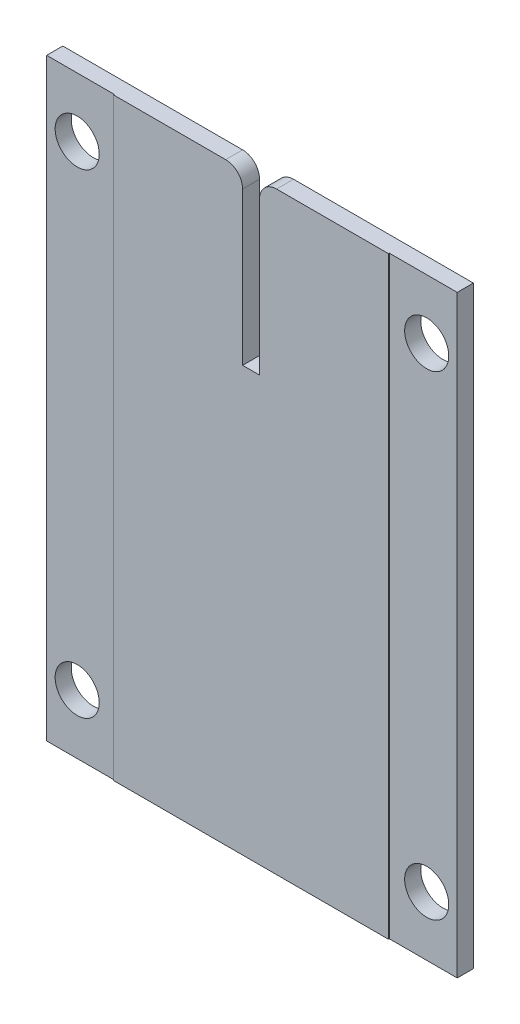
ISO-10303-21;
HEADER;
FILE_DESCRIPTION(('STEP AP214'),'2;1');
FILE_NAME('part.step','',(''),(''),'','','');
FILE_SCHEMA(('AUTOMOTIVE_DESIGN { 1 0 10303 214 1 1 1 1 }'));
ENDSEC;
DATA;
#1=APPLICATION_CONTEXT('core data for automotive mechanical design processes');
#2=APPLICATION_PROTOCOL_DEFINITION('international standard','automotive_design',2000,#1);
#3=PRODUCT_CONTEXT('',#1,'mechanical');
#4=PRODUCT('Part','Part','',(#3));
#5=PRODUCT_RELATED_PRODUCT_CATEGORY('part','',(#4));
#6=PRODUCT_DEFINITION_FORMATION('','',#4);
#7=PRODUCT_DEFINITION_CONTEXT('part definition',#1,'design');
#8=PRODUCT_DEFINITION('design','',#6,#7);
#9=PRODUCT_DEFINITION_SHAPE('','',#8);
#10=(LENGTH_UNIT() NAMED_UNIT(*) SI_UNIT(.MILLI.,.METRE.));
#11=(NAMED_UNIT(*) PLANE_ANGLE_UNIT() SI_UNIT($,.RADIAN.));
#12=(NAMED_UNIT(*) SI_UNIT($,.STERADIAN.) SOLID_ANGLE_UNIT());
#13=UNCERTAINTY_MEASURE_WITH_UNIT(LENGTH_MEASURE(1.E-05),#10,'distance_accuracy_value','');
#14=(GEOMETRIC_REPRESENTATION_CONTEXT(3) GLOBAL_UNCERTAINTY_ASSIGNED_CONTEXT((#13)) GLOBAL_UNIT_ASSIGNED_CONTEXT((#10,
#11,#12)) REPRESENTATION_CONTEXT('',''));
#15=CARTESIAN_POINT('',(0.,0.,0.));
#16=DIRECTION('',(0.,0.,1.));
#17=DIRECTION('',(1.,0.,0.));
#18=AXIS2_PLACEMENT_3D('',#15,#16,#17);
#19=CARTESIAN_POINT('',(121.,175.,10.));
#20=DIRECTION('',(0.,-1.,0.));
#21=DIRECTION('',(1.,0.,0.));
#22=AXIS2_PLACEMENT_3D('',#19,#20,#21);
#23=PLANE('',#22);
#24=DIRECTION('',(-1.,0.,0.));
#25=VECTOR('',#24,1.);
#26=CARTESIAN_POINT('',(121.,175.,0.));
#27=LINE('',#26,#25);
#28=CARTESIAN_POINT('',(121.,175.,0.));
#29=VERTEX_POINT('',#28);
#30=CARTESIAN_POINT('',(15.,175.,0.));
#31=VERTEX_POINT('',#30);
#32=EDGE_CURVE('E227',#29,#31,#27,.T.);
#33=ORIENTED_EDGE('',*,*,#32,.T.);
#34=DIRECTION('',(0.,0.,1.));
#35=VECTOR('',#34,1.);
#36=CARTESIAN_POINT('',(15.,175.,10.));
#37=LINE('',#36,#35);
#38=CARTESIAN_POINT('',(15.,175.,10.));
#39=VERTEX_POINT('',#38);
#40=EDGE_CURVE('E41',#31,#39,#37,.T.);
#41=ORIENTED_EDGE('',*,*,#40,.T.);
#42=DIRECTION('',(-1.,0.,0.));
#43=VECTOR('',#42,1.);
#44=CARTESIAN_POINT('',(121.,175.,10.));
#45=LINE('',#44,#43);
#46=CARTESIAN_POINT('',(81.,175.,10.));
#47=VERTEX_POINT('',#46);
#48=EDGE_CURVE('E228',#47,#39,#45,.T.);
#49=ORIENTED_EDGE('',*,*,#48,.F.);
#50=DIRECTION('',(0.,0.,1.));
#51=VECTOR('',#50,1.);
#52=CARTESIAN_POINT('',(81.,175.,9.5));
#53=LINE('',#52,#51);
#54=CARTESIAN_POINT('',(81.,175.,9.5));
#55=VERTEX_POINT('',#54);
#56=EDGE_CURVE('E179',#55,#47,#53,.T.);
#57=ORIENTED_EDGE('',*,*,#56,.F.);
#58=DIRECTION('',(-1.,0.,0.));
#59=VECTOR('',#58,1.);
#60=CARTESIAN_POINT('',(121.,175.,9.5));
#61=LINE('',#60,#59);
#62=CARTESIAN_POINT('',(121.,175.,9.5));
#63=VERTEX_POINT('',#62);
#64=EDGE_CURVE('E171',#63,#55,#61,.T.);
#65=ORIENTED_EDGE('',*,*,#64,.F.);
#66=DIRECTION('',(0.,0.,-1.));
#67=VECTOR('',#66,1.);
#68=CARTESIAN_POINT('',(121.,175.,10.));
#69=LINE('',#68,#67);
#70=EDGE_CURVE('E244',#63,#29,#69,.T.);
#71=ORIENTED_EDGE('',*,*,#70,.T.);
#72=EDGE_LOOP('',(#33,#41,#49,#57,#65,#71));
#73=FACE_BOUND('',#72,.T.);
#74=ADVANCED_FACE('F33',(#73),#23,.F.);
#75=CARTESIAN_POINT('',(-121.,-175.,10.));
#76=DIRECTION('',(1.,0.,0.));
#77=DIRECTION('',(0.,0.,-1.));
#78=AXIS2_PLACEMENT_3D('',#75,#76,#77);
#79=PLANE('',#78);
#80=DIRECTION('',(0.,-1.,0.));
#81=VECTOR('',#80,1.);
#82=CARTESIAN_POINT('',(-121.,175.,9.5));
#83=LINE('',#82,#81);
#84=CARTESIAN_POINT('',(-121.,175.,9.5));
#85=VERTEX_POINT('',#84);
#86=CARTESIAN_POINT('',(-121.,-175.,9.5));
#87=VERTEX_POINT('',#86);
#88=EDGE_CURVE('E190',#85,#87,#83,.T.);
#89=ORIENTED_EDGE('',*,*,#88,.F.);
#90=DIRECTION('',(0.,0.,-1.));
#91=VECTOR('',#90,1.);
#92=CARTESIAN_POINT('',(-121.,175.,10.));
#93=LINE('',#92,#91);
#94=CARTESIAN_POINT('',(-121.,175.,0.));
#95=VERTEX_POINT('',#94);
#96=EDGE_CURVE('E231',#85,#95,#93,.T.);
#97=ORIENTED_EDGE('',*,*,#96,.T.);
#98=DIRECTION('',(0.,-1.,0.));
#99=VECTOR('',#98,1.);
#100=CARTESIAN_POINT('',(-121.,-175.,0.));
#101=LINE('',#100,#99);
#102=CARTESIAN_POINT('',(-121.,-175.,0.));
#103=VERTEX_POINT('',#102);
#104=EDGE_CURVE('E222',#95,#103,#101,.T.);
#105=ORIENTED_EDGE('',*,*,#104,.T.);
#106=DIRECTION('',(0.,0.,-1.));
#107=VECTOR('',#106,1.);
#108=CARTESIAN_POINT('',(-121.,-175.,10.));
#109=LINE('',#108,#107);
#110=EDGE_CURVE('E248',#87,#103,#109,.T.);
#111=ORIENTED_EDGE('',*,*,#110,.F.);
#112=EDGE_LOOP('',(#89,#97,#105,#111));
#113=FACE_BOUND('',#112,.T.);
#114=ADVANCED_FACE('F295',(#113),#79,.F.);
#115=CARTESIAN_POINT('',(-103.,140.,10.));
#116=DIRECTION('',(0.,0.,-1.));
#117=DIRECTION('',(-1.,0.,0.));
#118=AXIS2_PLACEMENT_3D('',#115,#116,#117);
#119=CYLINDRICAL_SURFACE('',#118,13.);
#120=CARTESIAN_POINT('',(-103.,140.,0.));
#121=DIRECTION('',(0.,0.,1.));
#122=DIRECTION('',(1.,0.,0.));
#123=AXIS2_PLACEMENT_3D('',#120,#121,#122);
#124=CIRCLE('',#123,13.);
#125=CARTESIAN_POINT('',(-90.,140.,0.));
#126=VERTEX_POINT('',#125);
#127=EDGE_CURVE('E219',#126,#126,#124,.T.);
#128=ORIENTED_EDGE('',*,*,#127,.F.);
#129=EDGE_LOOP('',(#128));
#130=FACE_BOUND('',#129,.T.);
#131=CARTESIAN_POINT('',(-103.,140.,9.5));
#132=DIRECTION('',(0.,0.,1.));
#133=DIRECTION('',(1.,0.,0.));
#134=AXIS2_PLACEMENT_3D('',#131,#132,#133);
#135=CIRCLE('',#134,13.);
#136=CARTESIAN_POINT('',(-90.,140.,9.5));
#137=VERTEX_POINT('',#136);
#138=EDGE_CURVE('E207',#137,#137,#135,.T.);
#139=ORIENTED_EDGE('',*,*,#138,.T.);
#140=EDGE_LOOP('',(#139));
#141=FACE_BOUND('',#140,.T.);
#142=ADVANCED_FACE('F314',(#130,#141),#119,.F.);
#143=CARTESIAN_POINT('',(-103.,-140.,10.));
#144=DIRECTION('',(0.,0.,-1.));
#145=DIRECTION('',(-1.,0.,0.));
#146=AXIS2_PLACEMENT_3D('',#143,#144,#145);
#147=CYLINDRICAL_SURFACE('',#146,13.);
#148=CARTESIAN_POINT('',(-103.,-140.,0.));
#149=DIRECTION('',(0.,0.,1.));
#150=DIRECTION('',(1.,0.,0.));
#151=AXIS2_PLACEMENT_3D('',#148,#149,#150);
#152=CIRCLE('',#151,13.);
#153=CARTESIAN_POINT('',(-90.,-140.,0.));
#154=VERTEX_POINT('',#153);
#155=EDGE_CURVE('E216',#154,#154,#152,.T.);
#156=ORIENTED_EDGE('',*,*,#155,.F.);
#157=EDGE_LOOP('',(#156));
#158=FACE_BOUND('',#157,.T.);
#159=CARTESIAN_POINT('',(-103.,-140.,9.5));
#160=DIRECTION('',(0.,0.,1.));
#161=DIRECTION('',(1.,0.,0.));
#162=AXIS2_PLACEMENT_3D('',#159,#160,#161);
#163=CIRCLE('',#162,13.);
#164=CARTESIAN_POINT('',(-90.,-140.,9.5));
#165=VERTEX_POINT('',#164);
#166=EDGE_CURVE('E205',#165,#165,#163,.T.);
#167=ORIENTED_EDGE('',*,*,#166,.T.);
#168=EDGE_LOOP('',(#167));
#169=FACE_BOUND('',#168,.T.);
#170=ADVANCED_FACE('F337',(#158,#169),#147,.F.);
#171=CARTESIAN_POINT('',(0.,0.,10.));
#172=DIRECTION('',(0.,0.,1.));
#173=DIRECTION('',(1.,0.,0.));
#174=AXIS2_PLACEMENT_3D('',#171,#172,#173);
#175=PLANE('',#174);
#176=DIRECTION('',(0.,-1.,0.));
#177=VECTOR('',#176,1.);
#178=CARTESIAN_POINT('',(-5.00000000000002,75.,10.));
#179=LINE('',#178,#177);
#180=CARTESIAN_POINT('',(-5.00000000000002,165.,10.));
#181=VERTEX_POINT('',#180);
#182=CARTESIAN_POINT('',(-5.00000000000002,75.,10.));
#183=VERTEX_POINT('',#182);
#184=EDGE_CURVE('E152',#181,#183,#179,.T.);
#185=ORIENTED_EDGE('',*,*,#184,.F.);
#186=CARTESIAN_POINT('',(-15.,165.,10.));
#187=DIRECTION('',(0.,0.,1.));
#188=DIRECTION('',(1.,0.,0.));
#189=AXIS2_PLACEMENT_3D('',#186,#187,#188);
#190=CIRCLE('',#189,10.);
#191=CARTESIAN_POINT('',(-15.,175.,10.));
#192=VERTEX_POINT('',#191);
#193=EDGE_CURVE('E258',#181,#192,#190,.T.);
#194=ORIENTED_EDGE('',*,*,#193,.T.);
#195=CARTESIAN_POINT('',(-81.,175.,10.));
#196=VERTEX_POINT('',#195);
#197=EDGE_CURVE('E226',#192,#196,#45,.T.);
#198=ORIENTED_EDGE('',*,*,#197,.T.);
#199=DIRECTION('',(0.,1.,0.));
#200=VECTOR('',#199,1.);
#201=CARTESIAN_POINT('',(-81.,175.,10.));
#202=LINE('',#201,#200);
#203=CARTESIAN_POINT('',(-80.9999999999999,-175.,10.));
#204=VERTEX_POINT('',#203);
#205=EDGE_CURVE('E189',#204,#196,#202,.T.);
#206=ORIENTED_EDGE('',*,*,#205,.F.);
#207=DIRECTION('',(1.,0.,0.));
#208=VECTOR('',#207,1.);
#209=CARTESIAN_POINT('',(121.,-175.,10.));
#210=LINE('',#209,#208);
#211=CARTESIAN_POINT('',(81.,-175.,10.));
#212=VERTEX_POINT('',#211);
#213=EDGE_CURVE('E223',#204,#212,#210,.T.);
#214=ORIENTED_EDGE('',*,*,#213,.T.);
#215=DIRECTION('',(0.,-1.,0.));
#216=VECTOR('',#215,1.);
#217=CARTESIAN_POINT('',(81.,175.,10.));
#218=LINE('',#217,#216);
#219=EDGE_CURVE('E167',#47,#212,#218,.T.);
#220=ORIENTED_EDGE('',*,*,#219,.F.);
#221=ORIENTED_EDGE('',*,*,#48,.T.);
#222=CARTESIAN_POINT('',(15.,165.,10.));
#223=DIRECTION('',(0.,0.,1.));
#224=DIRECTION('',(1.,0.,0.));
#225=AXIS2_PLACEMENT_3D('',#222,#223,#224);
#226=CIRCLE('',#225,10.);
#227=CARTESIAN_POINT('',(4.99999999999999,165.,10.));
#228=VERTEX_POINT('',#227);
#229=EDGE_CURVE('E256',#39,#228,#226,.T.);
#230=ORIENTED_EDGE('',*,*,#229,.T.);
#231=DIRECTION('',(0.,1.,0.));
#232=VECTOR('',#231,1.);
#233=CARTESIAN_POINT('',(4.99999999999999,75.,10.));
#234=LINE('',#233,#232);
#235=CARTESIAN_POINT('',(4.99999999999999,75.,10.));
#236=VERTEX_POINT('',#235);
#237=EDGE_CURVE('E162',#236,#228,#234,.T.);
#238=ORIENTED_EDGE('',*,*,#237,.F.);
#239=DIRECTION('',(1.,0.,0.));
#240=VECTOR('',#239,1.);
#241=CARTESIAN_POINT('',(-5.00000000000002,75.,10.));
#242=LINE('',#241,#240);
#243=EDGE_CURVE('E165',#183,#236,#242,.T.);
#244=ORIENTED_EDGE('',*,*,#243,.F.);
#245=EDGE_LOOP('',(#185,#194,#198,#206,#214,#220,#221,#230,#238,#244));
#246=FACE_BOUND('',#245,.T.);
#247=ADVANCED_FACE('F271',(#246),#175,.T.);
#248=CARTESIAN_POINT('',(0.,0.,0.));
#249=DIRECTION('',(0.,0.,1.));
#250=DIRECTION('',(1.,0.,0.));
#251=AXIS2_PLACEMENT_3D('',#248,#249,#250);
#252=PLANE('',#251);
#253=CARTESIAN_POINT('',(-15.,175.,0.));
#254=VERTEX_POINT('',#253);
#255=EDGE_CURVE('E240',#254,#95,#27,.T.);
#256=ORIENTED_EDGE('',*,*,#255,.F.);
#257=CARTESIAN_POINT('',(-15.,165.,0.));
#258=DIRECTION('',(0.,0.,1.));
#259=DIRECTION('',(1.,0.,0.));
#260=AXIS2_PLACEMENT_3D('',#257,#258,#259);
#261=CIRCLE('',#260,10.);
#262=CARTESIAN_POINT('',(-5.00000000000002,165.,0.));
#263=VERTEX_POINT('',#262);
#264=EDGE_CURVE('E142',#254,#263,#261,.F.);
#265=ORIENTED_EDGE('',*,*,#264,.T.);
#266=DIRECTION('',(0.,-1.,0.));
#267=VECTOR('',#266,1.);
#268=CARTESIAN_POINT('',(-5.00000000000002,75.,0.));
#269=LINE('',#268,#267);
#270=CARTESIAN_POINT('',(-5.00000000000002,75.,0.));
#271=VERTEX_POINT('',#270);
#272=EDGE_CURVE('E134',#263,#271,#269,.T.);
#273=ORIENTED_EDGE('',*,*,#272,.T.);
#274=DIRECTION('',(1.,0.,0.));
#275=VECTOR('',#274,1.);
#276=CARTESIAN_POINT('',(-5.00000000000002,75.,0.));
#277=LINE('',#276,#275);
#278=CARTESIAN_POINT('',(4.99999999999999,75.,0.));
#279=VERTEX_POINT('',#278);
#280=EDGE_CURVE('E140',#271,#279,#277,.T.);
#281=ORIENTED_EDGE('',*,*,#280,.T.);
#282=DIRECTION('',(0.,1.,0.));
#283=VECTOR('',#282,1.);
#284=CARTESIAN_POINT('',(4.99999999999999,75.,0.));
#285=LINE('',#284,#283);
#286=CARTESIAN_POINT('',(4.99999999999999,165.,0.));
#287=VERTEX_POINT('',#286);
#288=EDGE_CURVE('E146',#279,#287,#285,.T.);
#289=ORIENTED_EDGE('',*,*,#288,.T.);
#290=CARTESIAN_POINT('',(15.,165.,0.));
#291=DIRECTION('',(0.,0.,1.));
#292=DIRECTION('',(1.,0.,0.));
#293=AXIS2_PLACEMENT_3D('',#290,#291,#292);
#294=CIRCLE('',#293,10.);
#295=EDGE_CURVE('E48',#287,#31,#294,.F.);
#296=ORIENTED_EDGE('',*,*,#295,.T.);
#297=ORIENTED_EDGE('',*,*,#32,.F.);
#298=DIRECTION('',(0.,1.,0.));
#299=VECTOR('',#298,1.);
#300=CARTESIAN_POINT('',(121.,-175.,0.));
#301=LINE('',#300,#299);
#302=CARTESIAN_POINT('',(121.,-175.,0.));
#303=VERTEX_POINT('',#302);
#304=EDGE_CURVE('E237',#303,#29,#301,.T.);
#305=ORIENTED_EDGE('',*,*,#304,.F.);
#306=DIRECTION('',(1.,0.,0.));
#307=VECTOR('',#306,1.);
#308=CARTESIAN_POINT('',(121.,-175.,0.));
#309=LINE('',#308,#307);
#310=EDGE_CURVE('E234',#103,#303,#309,.T.);
#311=ORIENTED_EDGE('',*,*,#310,.F.);
#312=ORIENTED_EDGE('',*,*,#104,.F.);
#313=EDGE_LOOP('',(#256,#265,#273,#281,#289,#296,#297,#305,#311,#312));
#314=FACE_BOUND('',#313,.T.);
#315=ORIENTED_EDGE('',*,*,#127,.T.);
#316=EDGE_LOOP('',(#315));
#317=FACE_BOUND('',#316,.T.);
#318=ORIENTED_EDGE('',*,*,#155,.T.);
#319=EDGE_LOOP('',(#318));
#320=FACE_BOUND('',#319,.T.);
#321=CARTESIAN_POINT('',(103.,140.,0.));
#322=DIRECTION('',(0.,0.,1.));
#323=DIRECTION('',(1.,0.,0.));
#324=AXIS2_PLACEMENT_3D('',#321,#322,#323);
#325=CIRCLE('',#324,13.);
#326=CARTESIAN_POINT('',(116.,140.,0.));
#327=VERTEX_POINT('',#326);
#328=EDGE_CURVE('E213',#327,#327,#325,.T.);
#329=ORIENTED_EDGE('',*,*,#328,.T.);
#330=EDGE_LOOP('',(#329));
#331=FACE_BOUND('',#330,.T.);
#332=CARTESIAN_POINT('',(103.,-140.,0.));
#333=DIRECTION('',(0.,0.,1.));
#334=DIRECTION('',(1.,0.,0.));
#335=AXIS2_PLACEMENT_3D('',#332,#333,#334);
#336=CIRCLE('',#335,13.);
#337=CARTESIAN_POINT('',(116.,-140.,0.));
#338=VERTEX_POINT('',#337);
#339=EDGE_CURVE('E210',#338,#338,#336,.T.);
#340=ORIENTED_EDGE('',*,*,#339,.T.);
#341=EDGE_LOOP('',(#340));
#342=FACE_BOUND('',#341,.T.);
#343=ADVANCED_FACE('F137',(#314,#317,#320,#331,#342),#252,.F.);
#344=CARTESIAN_POINT('',(121.,-175.,10.));
#345=DIRECTION('',(0.,1.,0.));
#346=DIRECTION('',(-1.,0.,0.));
#347=AXIS2_PLACEMENT_3D('',#344,#345,#346);
#348=PLANE('',#347);
#349=DIRECTION('',(1.,0.,0.));
#350=VECTOR('',#349,1.);
#351=CARTESIAN_POINT('',(121.,-175.,9.5));
#352=LINE('',#351,#350);
#353=CARTESIAN_POINT('',(81.,-175.,9.5));
#354=VERTEX_POINT('',#353);
#355=CARTESIAN_POINT('',(121.,-175.,9.5));
#356=VERTEX_POINT('',#355);
#357=EDGE_CURVE('E177',#354,#356,#352,.T.);
#358=ORIENTED_EDGE('',*,*,#357,.F.);
#359=DIRECTION('',(0.,0.,1.));
#360=VECTOR('',#359,1.);
#361=CARTESIAN_POINT('',(81.,-175.,9.5));
#362=LINE('',#361,#360);
#363=EDGE_CURVE('E181',#354,#212,#362,.T.);
#364=ORIENTED_EDGE('',*,*,#363,.T.);
#365=ORIENTED_EDGE('',*,*,#213,.F.);
#366=DIRECTION('',(0.,0.,1.));
#367=VECTOR('',#366,1.);
#368=CARTESIAN_POINT('',(-80.9999999999999,-175.,9.5));
#369=LINE('',#368,#367);
#370=CARTESIAN_POINT('',(-80.9999999999999,-175.,9.5));
#371=VERTEX_POINT('',#370);
#372=EDGE_CURVE('E199',#371,#204,#369,.T.);
#373=ORIENTED_EDGE('',*,*,#372,.F.);
#374=DIRECTION('',(1.,0.,0.));
#375=VECTOR('',#374,1.);
#376=CARTESIAN_POINT('',(-121.,-175.,9.5));
#377=LINE('',#376,#375);
#378=EDGE_CURVE('E192',#87,#371,#377,.T.);
#379=ORIENTED_EDGE('',*,*,#378,.F.);
#380=ORIENTED_EDGE('',*,*,#110,.T.);
#381=ORIENTED_EDGE('',*,*,#310,.T.);
#382=DIRECTION('',(0.,0.,-1.));
#383=VECTOR('',#382,1.);
#384=CARTESIAN_POINT('',(121.,-175.,10.));
#385=LINE('',#384,#383);
#386=EDGE_CURVE('E246',#356,#303,#385,.T.);
#387=ORIENTED_EDGE('',*,*,#386,.F.);
#388=EDGE_LOOP('',(#358,#364,#365,#373,#379,#380,#381,#387));
#389=FACE_BOUND('',#388,.T.);
#390=ADVANCED_FACE('F279',(#389),#348,.F.);
#391=CARTESIAN_POINT('',(121.,-175.,10.));
#392=DIRECTION('',(-1.,0.,0.));
#393=DIRECTION('',(0.,0.,1.));
#394=AXIS2_PLACEMENT_3D('',#391,#392,#393);
#395=PLANE('',#394);
#396=ORIENTED_EDGE('',*,*,#70,.F.);
#397=DIRECTION('',(0.,1.,0.));
#398=VECTOR('',#397,1.);
#399=CARTESIAN_POINT('',(121.,175.,9.5));
#400=LINE('',#399,#398);
#401=EDGE_CURVE('E169',#356,#63,#400,.T.);
#402=ORIENTED_EDGE('',*,*,#401,.F.);
#403=ORIENTED_EDGE('',*,*,#386,.T.);
#404=ORIENTED_EDGE('',*,*,#304,.T.);
#405=EDGE_LOOP('',(#396,#402,#403,#404));
#406=FACE_BOUND('',#405,.T.);
#407=ADVANCED_FACE('F288',(#406),#395,.F.);
#408=ORIENTED_EDGE('',*,*,#197,.F.);
#409=DIRECTION('',(0.,0.,1.));
#410=VECTOR('',#409,1.);
#411=CARTESIAN_POINT('',(-15.,175.,10.));
#412=LINE('',#411,#410);
#413=EDGE_CURVE('E260',#192,#254,#412,.F.);
#414=ORIENTED_EDGE('',*,*,#413,.T.);
#415=ORIENTED_EDGE('',*,*,#255,.T.);
#416=ORIENTED_EDGE('',*,*,#96,.F.);
#417=DIRECTION('',(-1.,0.,0.));
#418=VECTOR('',#417,1.);
#419=CARTESIAN_POINT('',(-121.,175.,9.5));
#420=LINE('',#419,#418);
#421=CARTESIAN_POINT('',(-80.9999999999999,175.,9.5));
#422=VERTEX_POINT('',#421);
#423=EDGE_CURVE('E197',#422,#85,#420,.T.);
#424=ORIENTED_EDGE('',*,*,#423,.F.);
#425=DIRECTION('',(0.,0.,1.));
#426=VECTOR('',#425,1.);
#427=CARTESIAN_POINT('',(-81.,175.,9.5));
#428=LINE('',#427,#426);
#429=EDGE_CURVE('E202',#422,#196,#428,.T.);
#430=ORIENTED_EDGE('',*,*,#429,.T.);
#431=EDGE_LOOP('',(#408,#414,#415,#416,#424,#430));
#432=FACE_BOUND('',#431,.T.);
#433=ADVANCED_FACE('F300',(#432),#23,.F.);
#434=CARTESIAN_POINT('',(103.,140.,10.));
#435=DIRECTION('',(0.,0.,-1.));
#436=DIRECTION('',(-1.,0.,0.));
#437=AXIS2_PLACEMENT_3D('',#434,#435,#436);
#438=CYLINDRICAL_SURFACE('',#437,13.);
#439=CARTESIAN_POINT('',(103.,140.,9.5));
#440=DIRECTION('',(0.,0.,-1.));
#441=DIRECTION('',(-1.,0.,0.));
#442=AXIS2_PLACEMENT_3D('',#439,#440,#441);
#443=CIRCLE('',#442,13.);
#444=CARTESIAN_POINT('',(90.,140.,9.5));
#445=VERTEX_POINT('',#444);
#446=EDGE_CURVE('E186',#445,#445,#443,.T.);
#447=ORIENTED_EDGE('',*,*,#446,.F.);
#448=EDGE_LOOP('',(#447));
#449=FACE_BOUND('',#448,.T.);
#450=ORIENTED_EDGE('',*,*,#328,.F.);
#451=EDGE_LOOP('',(#450));
#452=FACE_BOUND('',#451,.T.);
#453=ADVANCED_FACE('F319',(#449,#452),#438,.F.);
#454=CARTESIAN_POINT('',(103.,-140.,10.));
#455=DIRECTION('',(0.,0.,-1.));
#456=DIRECTION('',(-1.,0.,0.));
#457=AXIS2_PLACEMENT_3D('',#454,#455,#456);
#458=CYLINDRICAL_SURFACE('',#457,13.);
#459=CARTESIAN_POINT('',(103.,-140.,9.5));
#460=DIRECTION('',(0.,0.,-1.));
#461=DIRECTION('',(-1.,0.,0.));
#462=AXIS2_PLACEMENT_3D('',#459,#460,#461);
#463=CIRCLE('',#462,13.);
#464=CARTESIAN_POINT('',(90.,-140.,9.5));
#465=VERTEX_POINT('',#464);
#466=EDGE_CURVE('E184',#465,#465,#463,.T.);
#467=ORIENTED_EDGE('',*,*,#466,.F.);
#468=EDGE_LOOP('',(#467));
#469=FACE_BOUND('',#468,.T.);
#470=ORIENTED_EDGE('',*,*,#339,.F.);
#471=EDGE_LOOP('',(#470));
#472=FACE_BOUND('',#471,.T.);
#473=ADVANCED_FACE('F324',(#469,#472),#458,.F.);
#474=CARTESIAN_POINT('',(-81.,175.,9.5));
#475=DIRECTION('',(1.,0.,0.));
#476=DIRECTION('',(0.,1.,0.));
#477=AXIS2_PLACEMENT_3D('',#474,#475,#476);
#478=PLANE('',#477);
#479=ORIENTED_EDGE('',*,*,#205,.T.);
#480=ORIENTED_EDGE('',*,*,#429,.F.);
#481=DIRECTION('',(0.,1.,0.));
#482=VECTOR('',#481,1.);
#483=CARTESIAN_POINT('',(-81.,175.,9.5));
#484=LINE('',#483,#482);
#485=EDGE_CURVE('E195',#371,#422,#484,.T.);
#486=ORIENTED_EDGE('',*,*,#485,.F.);
#487=ORIENTED_EDGE('',*,*,#372,.T.);
#488=EDGE_LOOP('',(#479,#480,#486,#487));
#489=FACE_BOUND('',#488,.T.);
#490=ADVANCED_FACE('F348',(#489),#478,.F.);
#491=CARTESIAN_POINT('',(0.,0.,9.5));
#492=DIRECTION('',(0.,0.,1.));
#493=DIRECTION('',(1.,0.,0.));
#494=AXIS2_PLACEMENT_3D('',#491,#492,#493);
#495=PLANE('',#494);
#496=ORIENTED_EDGE('',*,*,#138,.F.);
#497=EDGE_LOOP('',(#496));
#498=FACE_BOUND('',#497,.T.);
#499=ORIENTED_EDGE('',*,*,#166,.F.);
#500=EDGE_LOOP('',(#499));
#501=FACE_BOUND('',#500,.T.);
#502=ORIENTED_EDGE('',*,*,#88,.T.);
#503=ORIENTED_EDGE('',*,*,#378,.T.);
#504=ORIENTED_EDGE('',*,*,#485,.T.);
#505=ORIENTED_EDGE('',*,*,#423,.T.);
#506=EDGE_LOOP('',(#502,#503,#504,#505));
#507=FACE_BOUND('',#506,.T.);
#508=ADVANCED_FACE('F352',(#498,#501,#507),#495,.T.);
#509=CARTESIAN_POINT('',(81.,175.,9.5));
#510=DIRECTION('',(-1.,0.,0.));
#511=DIRECTION('',(0.,-1.,0.));
#512=AXIS2_PLACEMENT_3D('',#509,#510,#511);
#513=PLANE('',#512);
#514=ORIENTED_EDGE('',*,*,#219,.T.);
#515=ORIENTED_EDGE('',*,*,#363,.F.);
#516=DIRECTION('',(0.,-1.,0.));
#517=VECTOR('',#516,1.);
#518=CARTESIAN_POINT('',(81.,175.,9.5));
#519=LINE('',#518,#517);
#520=EDGE_CURVE('E174',#55,#354,#519,.T.);
#521=ORIENTED_EDGE('',*,*,#520,.F.);
#522=ORIENTED_EDGE('',*,*,#56,.T.);
#523=EDGE_LOOP('',(#514,#515,#521,#522));
#524=FACE_BOUND('',#523,.T.);
#525=ADVANCED_FACE('F276',(#524),#513,.F.);
#526=CARTESIAN_POINT('',(0.,0.,9.5));
#527=DIRECTION('',(0.,0.,-1.));
#528=DIRECTION('',(-1.,0.,0.));
#529=AXIS2_PLACEMENT_3D('',#526,#527,#528);
#530=PLANE('',#529);
#531=ORIENTED_EDGE('',*,*,#446,.T.);
#532=EDGE_LOOP('',(#531));
#533=FACE_BOUND('',#532,.T.);
#534=ORIENTED_EDGE('',*,*,#466,.T.);
#535=EDGE_LOOP('',(#534));
#536=FACE_BOUND('',#535,.T.);
#537=ORIENTED_EDGE('',*,*,#401,.T.);
#538=ORIENTED_EDGE('',*,*,#64,.T.);
#539=ORIENTED_EDGE('',*,*,#520,.T.);
#540=ORIENTED_EDGE('',*,*,#357,.T.);
#541=EDGE_LOOP('',(#537,#538,#539,#540));
#542=FACE_BOUND('',#541,.T.);
#543=ADVANCED_FACE('F284',(#533,#536,#542),#530,.F.);
#544=CARTESIAN_POINT('',(4.99999999999999,75.,0.));
#545=DIRECTION('',(1.,0.,0.));
#546=DIRECTION('',(0.,0.,-1.));
#547=AXIS2_PLACEMENT_3D('',#544,#545,#546);
#548=PLANE('',#547);
#549=ORIENTED_EDGE('',*,*,#237,.T.);
#550=DIRECTION('',(0.,0.,1.));
#551=VECTOR('',#550,1.);
#552=CARTESIAN_POINT('',(4.99999999999999,165.,0.));
#553=LINE('',#552,#551);
#554=EDGE_CURVE('E11',#228,#287,#553,.F.);
#555=ORIENTED_EDGE('',*,*,#554,.T.);
#556=ORIENTED_EDGE('',*,*,#288,.F.);
#557=DIRECTION('',(0.,0.,1.));
#558=VECTOR('',#557,1.);
#559=CARTESIAN_POINT('',(4.99999999999999,75.,0.));
#560=LINE('',#559,#558);
#561=EDGE_CURVE('E156',#279,#236,#560,.T.);
#562=ORIENTED_EDGE('',*,*,#561,.T.);
#563=EDGE_LOOP('',(#549,#555,#556,#562));
#564=FACE_BOUND('',#563,.T.);
#565=ADVANCED_FACE('F304',(#564),#548,.F.);
#566=CARTESIAN_POINT('',(-5.00000000000002,75.,0.));
#567=DIRECTION('',(0.,-1.,0.));
#568=DIRECTION('',(0.,0.,-1.));
#569=AXIS2_PLACEMENT_3D('',#566,#567,#568);
#570=PLANE('',#569);
#571=ORIENTED_EDGE('',*,*,#243,.T.);
#572=ORIENTED_EDGE('',*,*,#561,.F.);
#573=ORIENTED_EDGE('',*,*,#280,.F.);
#574=DIRECTION('',(0.,0.,1.));
#575=VECTOR('',#574,1.);
#576=CARTESIAN_POINT('',(-5.00000000000002,75.,0.));
#577=LINE('',#576,#575);
#578=EDGE_CURVE('E149',#271,#183,#577,.T.);
#579=ORIENTED_EDGE('',*,*,#578,.T.);
#580=EDGE_LOOP('',(#571,#572,#573,#579));
#581=FACE_BOUND('',#580,.T.);
#582=ADVANCED_FACE('F158',(#581),#570,.F.);
#583=CARTESIAN_POINT('',(-5.00000000000002,75.,0.));
#584=DIRECTION('',(-1.,0.,0.));
#585=DIRECTION('',(0.,0.,1.));
#586=AXIS2_PLACEMENT_3D('',#583,#584,#585);
#587=PLANE('',#586);
#588=ORIENTED_EDGE('',*,*,#272,.F.);
#589=DIRECTION('',(0.,0.,1.));
#590=VECTOR('',#589,1.);
#591=CARTESIAN_POINT('',(-5.00000000000002,165.,0.));
#592=LINE('',#591,#590);
#593=EDGE_CURVE('E250',#263,#181,#592,.T.);
#594=ORIENTED_EDGE('',*,*,#593,.T.);
#595=ORIENTED_EDGE('',*,*,#184,.T.);
#596=ORIENTED_EDGE('',*,*,#578,.F.);
#597=EDGE_LOOP('',(#588,#594,#595,#596));
#598=FACE_BOUND('',#597,.T.);
#599=ADVANCED_FACE('F150',(#598),#587,.F.);
#600=CARTESIAN_POINT('',(-15.,165.,0.));
#601=DIRECTION('',(0.,0.,1.));
#602=DIRECTION('',(1.,0.,0.));
#603=AXIS2_PLACEMENT_3D('',#600,#601,#602);
#604=CYLINDRICAL_SURFACE('',#603,10.);
#605=ORIENTED_EDGE('',*,*,#264,.F.);
#606=ORIENTED_EDGE('',*,*,#413,.F.);
#607=ORIENTED_EDGE('',*,*,#193,.F.);
#608=ORIENTED_EDGE('',*,*,#593,.F.);
#609=EDGE_LOOP('',(#605,#606,#607,#608));
#610=FACE_BOUND('',#609,.T.);
#611=ADVANCED_FACE('F303',(#610),#604,.T.);
#612=CARTESIAN_POINT('',(15.,165.,10.));
#613=DIRECTION('',(0.,0.,1.));
#614=DIRECTION('',(1.,0.,0.));
#615=AXIS2_PLACEMENT_3D('',#612,#613,#614);
#616=CYLINDRICAL_SURFACE('',#615,10.);
#617=ORIENTED_EDGE('',*,*,#295,.F.);
#618=ORIENTED_EDGE('',*,*,#554,.F.);
#619=ORIENTED_EDGE('',*,*,#229,.F.);
#620=ORIENTED_EDGE('',*,*,#40,.F.);
#621=EDGE_LOOP('',(#617,#618,#619,#620));
#622=FACE_BOUND('',#621,.T.);
#623=ADVANCED_FACE('F35',(#622),#616,.T.);
#624=CLOSED_SHELL('',(#74,#114,#142,#170,#247,#343,#390,#407,#433,#453,#473,#490,#508,#525,#543,
#565,#582,#599,#611,#623));
#625=MANIFOLD_SOLID_BREP('B2',#624);
#626=ADVANCED_BREP_SHAPE_REPRESENTATION('',(#18,#625),#14);
#627=SHAPE_DEFINITION_REPRESENTATION(#9,#626);
ENDSEC;
END-ISO-10303-21;
